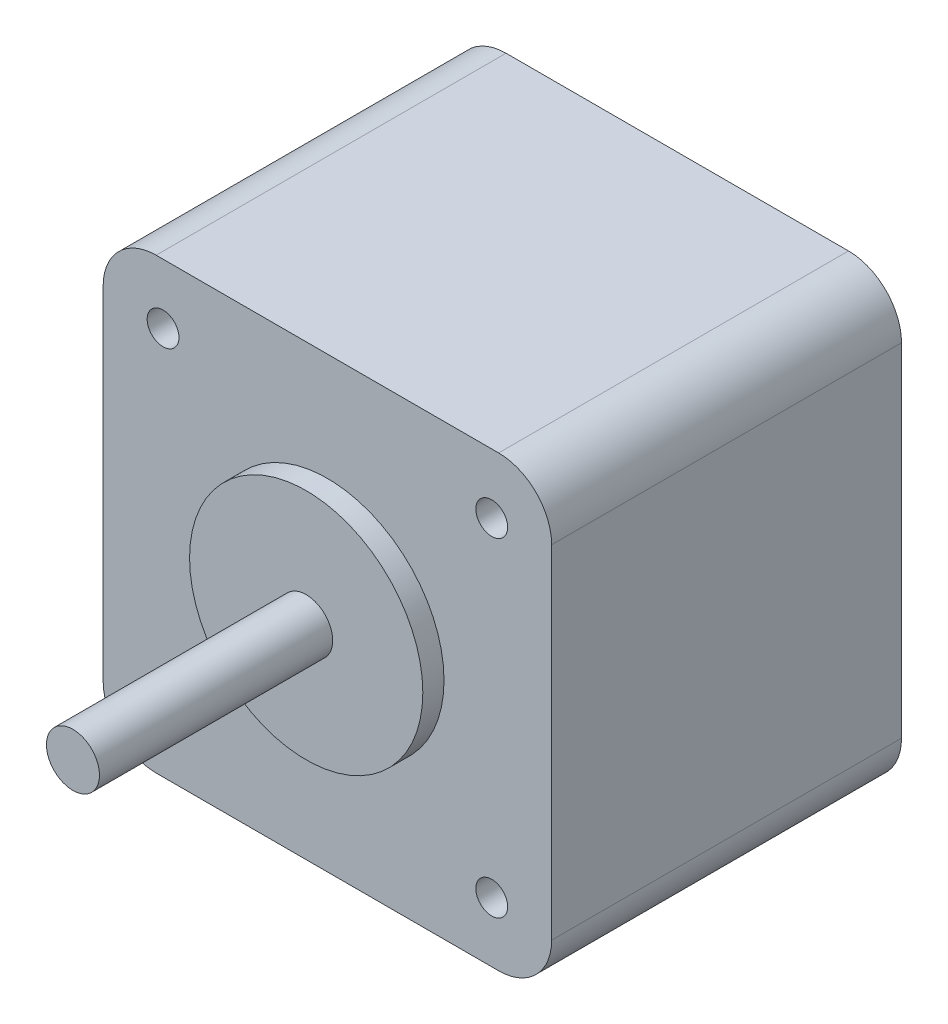
ISO-10303-21;
HEADER;
FILE_DESCRIPTION(('STEP AP214'),'2;1');
FILE_NAME('part.step','',(''),(''),'','','');
FILE_SCHEMA(('AUTOMOTIVE_DESIGN { 1 0 10303 214 1 1 1 1 }'));
ENDSEC;
DATA;
#1=APPLICATION_CONTEXT('core data for automotive mechanical design processes');
#2=APPLICATION_PROTOCOL_DEFINITION('international standard','automotive_design',2000,#1);
#3=PRODUCT_CONTEXT('',#1,'mechanical');
#4=PRODUCT('Part','Part','',(#3));
#5=PRODUCT_RELATED_PRODUCT_CATEGORY('part','',(#4));
#6=PRODUCT_DEFINITION_FORMATION('','',#4);
#7=PRODUCT_DEFINITION_CONTEXT('part definition',#1,'design');
#8=PRODUCT_DEFINITION('design','',#6,#7);
#9=PRODUCT_DEFINITION_SHAPE('','',#8);
#10=(LENGTH_UNIT() NAMED_UNIT(*) SI_UNIT(.MILLI.,.METRE.));
#11=(NAMED_UNIT(*) PLANE_ANGLE_UNIT() SI_UNIT($,.RADIAN.));
#12=(NAMED_UNIT(*) SI_UNIT($,.STERADIAN.) SOLID_ANGLE_UNIT());
#13=UNCERTAINTY_MEASURE_WITH_UNIT(LENGTH_MEASURE(1.E-05),#10,'distance_accuracy_value','');
#14=(GEOMETRIC_REPRESENTATION_CONTEXT(3) GLOBAL_UNCERTAINTY_ASSIGNED_CONTEXT((#13)) GLOBAL_UNIT_ASSIGNED_CONTEXT((#10,
#11,#12)) REPRESENTATION_CONTEXT('',''));
#15=CARTESIAN_POINT('',(0.,0.,0.));
#16=DIRECTION('',(0.,0.,1.));
#17=DIRECTION('',(1.,0.,0.));
#18=AXIS2_PLACEMENT_3D('',#15,#16,#17);
#19=CARTESIAN_POINT('',(-16.15,-16.15,16.5));
#20=DIRECTION('',(0.,0.,-1.));
#21=DIRECTION('',(-1.,0.,0.));
#22=AXIS2_PLACEMENT_3D('',#19,#20,#21);
#23=PLANE('',#22);
#24=CARTESIAN_POINT('',(-15.5,-15.5,16.5));
#25=DIRECTION('',(0.,0.,1.));
#26=DIRECTION('',(1.,0.,0.));
#27=AXIS2_PLACEMENT_3D('',#24,#25,#26);
#28=CIRCLE('',#27,1.5);
#29=CARTESIAN_POINT('',(-14.,-15.5,16.5));
#30=VERTEX_POINT('',#29);
#31=EDGE_CURVE('E166',#30,#30,#28,.T.);
#32=ORIENTED_EDGE('',*,*,#31,.F.);
#33=EDGE_LOOP('',(#32));
#34=FACE_BOUND('',#33,.T.);
#35=CARTESIAN_POINT('',(15.5,-15.5,16.5));
#36=DIRECTION('',(0.,0.,1.));
#37=DIRECTION('',(1.,0.,0.));
#38=AXIS2_PLACEMENT_3D('',#35,#36,#37);
#39=CIRCLE('',#38,1.5);
#40=CARTESIAN_POINT('',(17.,-15.5,16.5));
#41=VERTEX_POINT('',#40);
#42=EDGE_CURVE('E176',#41,#41,#39,.T.);
#43=ORIENTED_EDGE('',*,*,#42,.F.);
#44=EDGE_LOOP('',(#43));
#45=FACE_BOUND('',#44,.T.);
#46=CARTESIAN_POINT('',(15.5,15.5,16.5));
#47=DIRECTION('',(0.,0.,1.));
#48=DIRECTION('',(1.,0.,0.));
#49=AXIS2_PLACEMENT_3D('',#46,#47,#48);
#50=CIRCLE('',#49,1.5);
#51=CARTESIAN_POINT('',(17.,15.5,16.5));
#52=VERTEX_POINT('',#51);
#53=EDGE_CURVE('E182',#52,#52,#50,.T.);
#54=ORIENTED_EDGE('',*,*,#53,.F.);
#55=EDGE_LOOP('',(#54));
#56=FACE_BOUND('',#55,.T.);
#57=CARTESIAN_POINT('',(-15.5,15.5,16.5));
#58=DIRECTION('',(0.,0.,1.));
#59=DIRECTION('',(1.,0.,0.));
#60=AXIS2_PLACEMENT_3D('',#57,#58,#59);
#61=CIRCLE('',#60,1.5);
#62=CARTESIAN_POINT('',(-14.,15.5,16.5));
#63=VERTEX_POINT('',#62);
#64=EDGE_CURVE('E188',#63,#63,#61,.T.);
#65=ORIENTED_EDGE('',*,*,#64,.F.);
#66=EDGE_LOOP('',(#65));
#67=FACE_BOUND('',#66,.T.);
#68=CARTESIAN_POINT('',(-16.15,-16.15,16.5));
#69=DIRECTION('',(0.,0.,1.));
#70=DIRECTION('',(-1.,0.,0.));
#71=AXIS2_PLACEMENT_3D('',#68,#69,#70);
#72=CIRCLE('',#71,5.);
#73=CARTESIAN_POINT('',(-21.15,-16.15,16.5));
#74=VERTEX_POINT('',#73);
#75=CARTESIAN_POINT('',(-16.15,-21.15,16.5));
#76=VERTEX_POINT('',#75);
#77=EDGE_CURVE('E146',#74,#76,#72,.T.);
#78=ORIENTED_EDGE('',*,*,#77,.T.);
#79=DIRECTION('',(1.,0.,0.));
#80=VECTOR('',#79,1.);
#81=CARTESIAN_POINT('',(-16.15,-21.15,16.5));
#82=LINE('',#81,#80);
#83=CARTESIAN_POINT('',(16.15,-21.15,16.5));
#84=VERTEX_POINT('',#83);
#85=EDGE_CURVE('E94',#76,#84,#82,.T.);
#86=ORIENTED_EDGE('',*,*,#85,.T.);
#87=CARTESIAN_POINT('',(16.15,-16.15,16.5));
#88=DIRECTION('',(0.,0.,1.));
#89=DIRECTION('',(1.,0.,0.));
#90=AXIS2_PLACEMENT_3D('',#87,#88,#89);
#91=CIRCLE('',#90,5.);
#92=CARTESIAN_POINT('',(21.15,-16.15,16.5));
#93=VERTEX_POINT('',#92);
#94=EDGE_CURVE('E197',#84,#93,#91,.T.);
#95=ORIENTED_EDGE('',*,*,#94,.T.);
#96=DIRECTION('',(0.,1.,0.));
#97=VECTOR('',#96,1.);
#98=CARTESIAN_POINT('',(21.15,-16.15,16.5));
#99=LINE('',#98,#97);
#100=CARTESIAN_POINT('',(21.15,16.15,16.5));
#101=VERTEX_POINT('',#100);
#102=EDGE_CURVE('E199',#93,#101,#99,.T.);
#103=ORIENTED_EDGE('',*,*,#102,.T.);
#104=CARTESIAN_POINT('',(16.15,16.15,16.5));
#105=DIRECTION('',(0.,0.,1.));
#106=DIRECTION('',(-1.,0.,0.));
#107=AXIS2_PLACEMENT_3D('',#104,#105,#106);
#108=CIRCLE('',#107,5.);
#109=CARTESIAN_POINT('',(16.15,21.15,16.5));
#110=VERTEX_POINT('',#109);
#111=EDGE_CURVE('E113',#101,#110,#108,.T.);
#112=ORIENTED_EDGE('',*,*,#111,.T.);
#113=DIRECTION('',(-1.,0.,0.));
#114=VECTOR('',#113,1.);
#115=CARTESIAN_POINT('',(-16.15,21.15,16.5));
#116=LINE('',#115,#114);
#117=CARTESIAN_POINT('',(-16.15,21.15,16.5));
#118=VERTEX_POINT('',#117);
#119=EDGE_CURVE('E107',#110,#118,#116,.T.);
#120=ORIENTED_EDGE('',*,*,#119,.T.);
#121=CARTESIAN_POINT('',(-16.15,16.15,16.5));
#122=DIRECTION('',(0.,0.,1.));
#123=DIRECTION('',(1.,0.,0.));
#124=AXIS2_PLACEMENT_3D('',#121,#122,#123);
#125=CIRCLE('',#124,5.);
#126=CARTESIAN_POINT('',(-21.15,16.15,16.5));
#127=VERTEX_POINT('',#126);
#128=EDGE_CURVE('E111',#118,#127,#125,.T.);
#129=ORIENTED_EDGE('',*,*,#128,.T.);
#130=DIRECTION('',(0.,-1.,0.));
#131=VECTOR('',#130,1.);
#132=CARTESIAN_POINT('',(-21.15,-16.15,16.5));
#133=LINE('',#132,#131);
#134=EDGE_CURVE('E50',#127,#74,#133,.T.);
#135=ORIENTED_EDGE('',*,*,#134,.T.);
#136=EDGE_LOOP('',(#78,#86,#95,#103,#112,#120,#129,#135));
#137=FACE_BOUND('',#136,.T.);
#138=CARTESIAN_POINT('',(0.,0.,16.5));
#139=DIRECTION('',(0.,0.,-1.));
#140=DIRECTION('',(-1.,0.,0.));
#141=AXIS2_PLACEMENT_3D('',#138,#139,#140);
#142=CIRCLE('',#141,11.);
#143=CARTESIAN_POINT('',(-11.,0.,16.5));
#144=VERTEX_POINT('',#143);
#145=EDGE_CURVE('E11',#144,#144,#142,.F.);
#146=ORIENTED_EDGE('',*,*,#145,.F.);
#147=EDGE_LOOP('',(#146));
#148=FACE_BOUND('',#147,.T.);
#149=ADVANCED_FACE('F33',(#34,#45,#56,#67,#137,#148),#23,.F.);
#150=CARTESIAN_POINT('',(-16.15,-16.15,16.5));
#151=DIRECTION('',(0.,0.,-1.));
#152=DIRECTION('',(-1.,0.,0.));
#153=AXIS2_PLACEMENT_3D('',#150,#151,#152);
#154=CYLINDRICAL_SURFACE('',#153,5.);
#155=CARTESIAN_POINT('',(-16.15,-16.15,-16.5));
#156=DIRECTION('',(0.,0.,1.));
#157=DIRECTION('',(-1.,0.,0.));
#158=AXIS2_PLACEMENT_3D('',#155,#156,#157);
#159=CIRCLE('',#158,5.);
#160=CARTESIAN_POINT('',(-21.15,-16.15,-16.5));
#161=VERTEX_POINT('',#160);
#162=CARTESIAN_POINT('',(-16.15,-21.15,-16.5));
#163=VERTEX_POINT('',#162);
#164=EDGE_CURVE('E131',#161,#163,#159,.T.);
#165=ORIENTED_EDGE('',*,*,#164,.T.);
#166=DIRECTION('',(0.,0.,-1.));
#167=VECTOR('',#166,1.);
#168=CARTESIAN_POINT('',(-16.15,-21.15,16.5));
#169=LINE('',#168,#167);
#170=EDGE_CURVE('E42',#76,#163,#169,.T.);
#171=ORIENTED_EDGE('',*,*,#170,.F.);
#172=ORIENTED_EDGE('',*,*,#77,.F.);
#173=DIRECTION('',(0.,0.,-1.));
#174=VECTOR('',#173,1.);
#175=CARTESIAN_POINT('',(-21.15,-16.15,16.5));
#176=LINE('',#175,#174);
#177=EDGE_CURVE('E127',#74,#161,#176,.T.);
#178=ORIENTED_EDGE('',*,*,#177,.T.);
#179=EDGE_LOOP('',(#165,#171,#172,#178));
#180=FACE_BOUND('',#179,.T.);
#181=ADVANCED_FACE('F35',(#180),#154,.T.);
#182=CARTESIAN_POINT('',(-16.15,-21.15,16.5));
#183=DIRECTION('',(0.,1.,0.));
#184=DIRECTION('',(0.,0.,1.));
#185=AXIS2_PLACEMENT_3D('',#182,#183,#184);
#186=PLANE('',#185);
#187=DIRECTION('',(1.,0.,0.));
#188=VECTOR('',#187,1.);
#189=CARTESIAN_POINT('',(-16.15,-21.15,-16.5));
#190=LINE('',#189,#188);
#191=CARTESIAN_POINT('',(16.15,-21.15,-16.5));
#192=VERTEX_POINT('',#191);
#193=EDGE_CURVE('E134',#163,#192,#190,.T.);
#194=ORIENTED_EDGE('',*,*,#193,.T.);
#195=DIRECTION('',(0.,0.,-1.));
#196=VECTOR('',#195,1.);
#197=CARTESIAN_POINT('',(16.15,-21.15,16.5));
#198=LINE('',#197,#196);
#199=EDGE_CURVE('E156',#84,#192,#198,.T.);
#200=ORIENTED_EDGE('',*,*,#199,.F.);
#201=ORIENTED_EDGE('',*,*,#85,.F.);
#202=ORIENTED_EDGE('',*,*,#170,.T.);
#203=EDGE_LOOP('',(#194,#200,#201,#202));
#204=FACE_BOUND('',#203,.T.);
#205=ADVANCED_FACE('F234',(#204),#186,.F.);
#206=CARTESIAN_POINT('',(16.15,-16.15,16.5));
#207=DIRECTION('',(0.,0.,-1.));
#208=DIRECTION('',(-1.,0.,0.));
#209=AXIS2_PLACEMENT_3D('',#206,#207,#208);
#210=CYLINDRICAL_SURFACE('',#209,5.);
#211=CARTESIAN_POINT('',(16.15,-16.15,-16.5));
#212=DIRECTION('',(0.,0.,1.));
#213=DIRECTION('',(1.,0.,0.));
#214=AXIS2_PLACEMENT_3D('',#211,#212,#213);
#215=CIRCLE('',#214,5.);
#216=CARTESIAN_POINT('',(21.15,-16.15,-16.5));
#217=VERTEX_POINT('',#216);
#218=EDGE_CURVE('E137',#192,#217,#215,.T.);
#219=ORIENTED_EDGE('',*,*,#218,.T.);
#220=DIRECTION('',(0.,0.,-1.));
#221=VECTOR('',#220,1.);
#222=CARTESIAN_POINT('',(21.15,-16.15,16.5));
#223=LINE('',#222,#221);
#224=EDGE_CURVE('E153',#93,#217,#223,.T.);
#225=ORIENTED_EDGE('',*,*,#224,.F.);
#226=ORIENTED_EDGE('',*,*,#94,.F.);
#227=ORIENTED_EDGE('',*,*,#199,.T.);
#228=EDGE_LOOP('',(#219,#225,#226,#227));
#229=FACE_BOUND('',#228,.T.);
#230=ADVANCED_FACE('F350',(#229),#210,.T.);
#231=CARTESIAN_POINT('',(21.15,-16.15,16.5));
#232=DIRECTION('',(-1.,0.,0.));
#233=DIRECTION('',(0.,0.,1.));
#234=AXIS2_PLACEMENT_3D('',#231,#232,#233);
#235=PLANE('',#234);
#236=DIRECTION('',(0.,1.,0.));
#237=VECTOR('',#236,1.);
#238=CARTESIAN_POINT('',(21.15,-16.15,-16.5));
#239=LINE('',#238,#237);
#240=CARTESIAN_POINT('',(21.15,16.15,-16.5));
#241=VERTEX_POINT('',#240);
#242=EDGE_CURVE('E139',#217,#241,#239,.T.);
#243=ORIENTED_EDGE('',*,*,#242,.T.);
#244=DIRECTION('',(0.,0.,-1.));
#245=VECTOR('',#244,1.);
#246=CARTESIAN_POINT('',(21.15,16.15,16.5));
#247=LINE('',#246,#245);
#248=EDGE_CURVE('E150',#101,#241,#247,.T.);
#249=ORIENTED_EDGE('',*,*,#248,.F.);
#250=ORIENTED_EDGE('',*,*,#102,.F.);
#251=ORIENTED_EDGE('',*,*,#224,.T.);
#252=EDGE_LOOP('',(#243,#249,#250,#251));
#253=FACE_BOUND('',#252,.T.);
#254=ADVANCED_FACE('F205',(#253),#235,.F.);
#255=CARTESIAN_POINT('',(16.15,16.15,16.5));
#256=DIRECTION('',(0.,0.,-1.));
#257=DIRECTION('',(-1.,0.,0.));
#258=AXIS2_PLACEMENT_3D('',#255,#256,#257);
#259=CYLINDRICAL_SURFACE('',#258,5.);
#260=CARTESIAN_POINT('',(16.15,16.15,-16.5));
#261=DIRECTION('',(0.,0.,1.));
#262=DIRECTION('',(-1.,0.,0.));
#263=AXIS2_PLACEMENT_3D('',#260,#261,#262);
#264=CIRCLE('',#263,5.);
#265=CARTESIAN_POINT('',(16.15,21.15,-16.5));
#266=VERTEX_POINT('',#265);
#267=EDGE_CURVE('E141',#241,#266,#264,.T.);
#268=ORIENTED_EDGE('',*,*,#267,.T.);
#269=DIRECTION('',(0.,0.,-1.));
#270=VECTOR('',#269,1.);
#271=CARTESIAN_POINT('',(16.15,21.15,16.5));
#272=LINE('',#271,#270);
#273=EDGE_CURVE('E122',#110,#266,#272,.T.);
#274=ORIENTED_EDGE('',*,*,#273,.F.);
#275=ORIENTED_EDGE('',*,*,#111,.F.);
#276=ORIENTED_EDGE('',*,*,#248,.T.);
#277=EDGE_LOOP('',(#268,#274,#275,#276));
#278=FACE_BOUND('',#277,.T.);
#279=ADVANCED_FACE('F209',(#278),#259,.T.);
#280=CARTESIAN_POINT('',(-16.15,21.15,16.5));
#281=DIRECTION('',(0.,-1.,0.));
#282=DIRECTION('',(0.,0.,-1.));
#283=AXIS2_PLACEMENT_3D('',#280,#281,#282);
#284=PLANE('',#283);
#285=DIRECTION('',(-1.,0.,0.));
#286=VECTOR('',#285,1.);
#287=CARTESIAN_POINT('',(-16.15,21.15,-16.5));
#288=LINE('',#287,#286);
#289=CARTESIAN_POINT('',(-16.15,21.15,-16.5));
#290=VERTEX_POINT('',#289);
#291=EDGE_CURVE('E121',#266,#290,#288,.T.);
#292=ORIENTED_EDGE('',*,*,#291,.T.);
#293=DIRECTION('',(0.,0.,-1.));
#294=VECTOR('',#293,1.);
#295=CARTESIAN_POINT('',(-16.15,21.15,16.5));
#296=LINE('',#295,#294);
#297=EDGE_CURVE('E118',#118,#290,#296,.T.);
#298=ORIENTED_EDGE('',*,*,#297,.F.);
#299=ORIENTED_EDGE('',*,*,#119,.F.);
#300=ORIENTED_EDGE('',*,*,#273,.T.);
#301=EDGE_LOOP('',(#292,#298,#299,#300));
#302=FACE_BOUND('',#301,.T.);
#303=ADVANCED_FACE('F119',(#302),#284,.F.);
#304=CARTESIAN_POINT('',(-16.15,16.15,16.5));
#305=DIRECTION('',(0.,0.,-1.));
#306=DIRECTION('',(-1.,0.,0.));
#307=AXIS2_PLACEMENT_3D('',#304,#305,#306);
#308=CYLINDRICAL_SURFACE('',#307,5.);
#309=CARTESIAN_POINT('',(-16.15,16.15,-16.5));
#310=DIRECTION('',(0.,0.,1.));
#311=DIRECTION('',(1.,0.,0.));
#312=AXIS2_PLACEMENT_3D('',#309,#310,#311);
#313=CIRCLE('',#312,5.);
#314=CARTESIAN_POINT('',(-21.15,16.15,-16.5));
#315=VERTEX_POINT('',#314);
#316=EDGE_CURVE('E79',#290,#315,#313,.T.);
#317=ORIENTED_EDGE('',*,*,#316,.T.);
#318=DIRECTION('',(0.,0.,-1.));
#319=VECTOR('',#318,1.);
#320=CARTESIAN_POINT('',(-21.15,16.15,16.5));
#321=LINE('',#320,#319);
#322=EDGE_CURVE('E123',#127,#315,#321,.T.);
#323=ORIENTED_EDGE('',*,*,#322,.F.);
#324=ORIENTED_EDGE('',*,*,#128,.F.);
#325=ORIENTED_EDGE('',*,*,#297,.T.);
#326=EDGE_LOOP('',(#317,#323,#324,#325));
#327=FACE_BOUND('',#326,.T.);
#328=ADVANCED_FACE('F125',(#327),#308,.T.);
#329=CARTESIAN_POINT('',(-21.15,-16.15,16.5));
#330=DIRECTION('',(1.,0.,0.));
#331=DIRECTION('',(0.,0.,-1.));
#332=AXIS2_PLACEMENT_3D('',#329,#330,#331);
#333=PLANE('',#332);
#334=DIRECTION('',(0.,-1.,0.));
#335=VECTOR('',#334,1.);
#336=CARTESIAN_POINT('',(-21.15,-16.15,-16.5));
#337=LINE('',#336,#335);
#338=EDGE_CURVE('E85',#315,#161,#337,.T.);
#339=ORIENTED_EDGE('',*,*,#338,.T.);
#340=ORIENTED_EDGE('',*,*,#177,.F.);
#341=ORIENTED_EDGE('',*,*,#134,.F.);
#342=ORIENTED_EDGE('',*,*,#322,.T.);
#343=EDGE_LOOP('',(#339,#340,#341,#342));
#344=FACE_BOUND('',#343,.T.);
#345=ADVANCED_FACE('F217',(#344),#333,.F.);
#346=CARTESIAN_POINT('',(-16.15,-16.15,-16.5));
#347=DIRECTION('',(0.,0.,-1.));
#348=DIRECTION('',(-1.,0.,0.));
#349=AXIS2_PLACEMENT_3D('',#346,#347,#348);
#350=PLANE('',#349);
#351=CARTESIAN_POINT('',(-15.5,-15.5,-16.5));
#352=DIRECTION('',(0.,0.,1.));
#353=DIRECTION('',(1.,0.,0.));
#354=AXIS2_PLACEMENT_3D('',#351,#352,#353);
#355=CIRCLE('',#354,1.5);
#356=CARTESIAN_POINT('',(-14.,-15.5,-16.5));
#357=VERTEX_POINT('',#356);
#358=EDGE_CURVE('E173',#357,#357,#355,.T.);
#359=ORIENTED_EDGE('',*,*,#358,.T.);
#360=EDGE_LOOP('',(#359));
#361=FACE_BOUND('',#360,.T.);
#362=CARTESIAN_POINT('',(15.5,-15.5,-16.5));
#363=DIRECTION('',(0.,0.,1.));
#364=DIRECTION('',(1.,0.,0.));
#365=AXIS2_PLACEMENT_3D('',#362,#363,#364);
#366=CIRCLE('',#365,1.5);
#367=CARTESIAN_POINT('',(17.,-15.5,-16.5));
#368=VERTEX_POINT('',#367);
#369=EDGE_CURVE('E179',#368,#368,#366,.T.);
#370=ORIENTED_EDGE('',*,*,#369,.T.);
#371=EDGE_LOOP('',(#370));
#372=FACE_BOUND('',#371,.T.);
#373=CARTESIAN_POINT('',(15.5,15.5,-16.5));
#374=DIRECTION('',(0.,0.,1.));
#375=DIRECTION('',(1.,0.,0.));
#376=AXIS2_PLACEMENT_3D('',#373,#374,#375);
#377=CIRCLE('',#376,1.5);
#378=CARTESIAN_POINT('',(17.,15.5,-16.5));
#379=VERTEX_POINT('',#378);
#380=EDGE_CURVE('E185',#379,#379,#377,.T.);
#381=ORIENTED_EDGE('',*,*,#380,.T.);
#382=EDGE_LOOP('',(#381));
#383=FACE_BOUND('',#382,.T.);
#384=CARTESIAN_POINT('',(-15.5,15.5,-16.5));
#385=DIRECTION('',(0.,0.,1.));
#386=DIRECTION('',(1.,0.,0.));
#387=AXIS2_PLACEMENT_3D('',#384,#385,#386);
#388=CIRCLE('',#387,1.5);
#389=CARTESIAN_POINT('',(-14.,15.5,-16.5));
#390=VERTEX_POINT('',#389);
#391=EDGE_CURVE('E135',#390,#390,#388,.T.);
#392=ORIENTED_EDGE('',*,*,#391,.T.);
#393=EDGE_LOOP('',(#392));
#394=FACE_BOUND('',#393,.T.);
#395=ORIENTED_EDGE('',*,*,#164,.F.);
#396=ORIENTED_EDGE('',*,*,#338,.F.);
#397=ORIENTED_EDGE('',*,*,#316,.F.);
#398=ORIENTED_EDGE('',*,*,#291,.F.);
#399=ORIENTED_EDGE('',*,*,#267,.F.);
#400=ORIENTED_EDGE('',*,*,#242,.F.);
#401=ORIENTED_EDGE('',*,*,#218,.F.);
#402=ORIENTED_EDGE('',*,*,#193,.F.);
#403=EDGE_LOOP('',(#395,#396,#397,#398,#399,#400,#401,#402));
#404=FACE_BOUND('',#403,.T.);
#405=ADVANCED_FACE('F212',(#361,#372,#383,#394,#404),#350,.T.);
#406=CARTESIAN_POINT('',(-15.5,15.5,-16.5));
#407=DIRECTION('',(0.,0.,1.));
#408=DIRECTION('',(1.,0.,0.));
#409=AXIS2_PLACEMENT_3D('',#406,#407,#408);
#410=CYLINDRICAL_SURFACE('',#409,1.5);
#411=ORIENTED_EDGE('',*,*,#391,.F.);
#412=EDGE_LOOP('',(#411));
#413=FACE_BOUND('',#412,.T.);
#414=ORIENTED_EDGE('',*,*,#64,.T.);
#415=EDGE_LOOP('',(#414));
#416=FACE_BOUND('',#415,.T.);
#417=ADVANCED_FACE('F224',(#413,#416),#410,.F.);
#418=CARTESIAN_POINT('',(15.5,15.5,-16.5));
#419=DIRECTION('',(0.,0.,1.));
#420=DIRECTION('',(1.,0.,0.));
#421=AXIS2_PLACEMENT_3D('',#418,#419,#420);
#422=CYLINDRICAL_SURFACE('',#421,1.5);
#423=ORIENTED_EDGE('',*,*,#380,.F.);
#424=EDGE_LOOP('',(#423));
#425=FACE_BOUND('',#424,.T.);
#426=ORIENTED_EDGE('',*,*,#53,.T.);
#427=EDGE_LOOP('',(#426));
#428=FACE_BOUND('',#427,.T.);
#429=ADVANCED_FACE('F240',(#425,#428),#422,.F.);
#430=CARTESIAN_POINT('',(15.5,-15.5,-16.5));
#431=DIRECTION('',(0.,0.,1.));
#432=DIRECTION('',(1.,0.,0.));
#433=AXIS2_PLACEMENT_3D('',#430,#431,#432);
#434=CYLINDRICAL_SURFACE('',#433,1.5);
#435=ORIENTED_EDGE('',*,*,#369,.F.);
#436=EDGE_LOOP('',(#435));
#437=FACE_BOUND('',#436,.T.);
#438=ORIENTED_EDGE('',*,*,#42,.T.);
#439=EDGE_LOOP('',(#438));
#440=FACE_BOUND('',#439,.T.);
#441=ADVANCED_FACE('F244',(#437,#440),#434,.F.);
#442=CARTESIAN_POINT('',(-15.5,-15.5,-16.5));
#443=DIRECTION('',(0.,0.,1.));
#444=DIRECTION('',(1.,0.,0.));
#445=AXIS2_PLACEMENT_3D('',#442,#443,#444);
#446=CYLINDRICAL_SURFACE('',#445,1.5);
#447=ORIENTED_EDGE('',*,*,#358,.F.);
#448=EDGE_LOOP('',(#447));
#449=FACE_BOUND('',#448,.T.);
#450=ORIENTED_EDGE('',*,*,#31,.T.);
#451=EDGE_LOOP('',(#450));
#452=FACE_BOUND('',#451,.T.);
#453=ADVANCED_FACE('F248',(#449,#452),#446,.F.);
#454=CARTESIAN_POINT('',(0.,0.,18.5));
#455=DIRECTION('',(0.,0.,1.));
#456=DIRECTION('',(1.,0.,0.));
#457=AXIS2_PLACEMENT_3D('',#454,#455,#456);
#458=PLANE('',#457);
#459=CARTESIAN_POINT('',(0.,0.,18.5));
#460=DIRECTION('',(0.,0.,1.));
#461=DIRECTION('',(1.,0.,0.));
#462=AXIS2_PLACEMENT_3D('',#459,#460,#461);
#463=CIRCLE('',#462,11.);
#464=CARTESIAN_POINT('',(11.,0.,18.5));
#465=VERTEX_POINT('',#464);
#466=EDGE_CURVE('E162',#465,#465,#463,.T.);
#467=ORIENTED_EDGE('',*,*,#466,.T.);
#468=EDGE_LOOP('',(#467));
#469=FACE_BOUND('',#468,.T.);
#470=CARTESIAN_POINT('',(0.,0.,18.5));
#471=DIRECTION('',(0.,0.,1.));
#472=DIRECTION('',(1.,0.,0.));
#473=AXIS2_PLACEMENT_3D('',#470,#471,#472);
#474=CIRCLE('',#473,2.5);
#475=CARTESIAN_POINT('',(2.5,0.,18.5));
#476=VERTEX_POINT('',#475);
#477=EDGE_CURVE('E159',#476,#476,#474,.T.);
#478=ORIENTED_EDGE('',*,*,#477,.F.);
#479=EDGE_LOOP('',(#478));
#480=FACE_BOUND('',#479,.T.);
#481=ADVANCED_FACE('F252',(#469,#480),#458,.T.);
#482=CARTESIAN_POINT('',(0.,0.,18.5));
#483=DIRECTION('',(0.,0.,-1.));
#484=DIRECTION('',(-1.,0.,0.));
#485=AXIS2_PLACEMENT_3D('',#482,#483,#484);
#486=CYLINDRICAL_SURFACE('',#485,11.);
#487=ORIENTED_EDGE('',*,*,#466,.F.);
#488=EDGE_LOOP('',(#487));
#489=FACE_BOUND('',#488,.T.);
#490=ORIENTED_EDGE('',*,*,#145,.T.);
#491=EDGE_LOOP('',(#490));
#492=FACE_BOUND('',#491,.T.);
#493=ADVANCED_FACE('F260',(#489,#492),#486,.T.);
#494=CARTESIAN_POINT('',(0.,0.,40.5));
#495=DIRECTION('',(0.,0.,1.));
#496=DIRECTION('',(1.,0.,0.));
#497=AXIS2_PLACEMENT_3D('',#494,#495,#496);
#498=PLANE('',#497);
#499=CARTESIAN_POINT('',(0.,0.,40.5));
#500=DIRECTION('',(0.,0.,1.));
#501=DIRECTION('',(1.,0.,0.));
#502=AXIS2_PLACEMENT_3D('',#499,#500,#501);
#503=CIRCLE('',#502,2.5);
#504=CARTESIAN_POINT('',(2.5,0.,40.5));
#505=VERTEX_POINT('',#504);
#506=EDGE_CURVE('E161',#505,#505,#503,.T.);
#507=ORIENTED_EDGE('',*,*,#506,.T.);
#508=EDGE_LOOP('',(#507));
#509=FACE_BOUND('',#508,.T.);
#510=ADVANCED_FACE('F257',(#509),#498,.T.);
#511=CARTESIAN_POINT('',(0.,0.,40.5));
#512=DIRECTION('',(0.,0.,-1.));
#513=DIRECTION('',(-1.,0.,0.));
#514=AXIS2_PLACEMENT_3D('',#511,#512,#513);
#515=CYLINDRICAL_SURFACE('',#514,2.5);
#516=ORIENTED_EDGE('',*,*,#477,.T.);
#517=EDGE_LOOP('',(#516));
#518=FACE_BOUND('',#517,.T.);
#519=ORIENTED_EDGE('',*,*,#506,.F.);
#520=EDGE_LOOP('',(#519));
#521=FACE_BOUND('',#520,.T.);
#522=ADVANCED_FACE('F254',(#518,#521),#515,.T.);
#523=CLOSED_SHELL('',(#149,#181,#205,#230,#254,#279,#303,#328,#345,#405,#417,#429,#441,#453,
#481,#493,#510,#522));
#524=MANIFOLD_SOLID_BREP('B2',#523);
#525=ADVANCED_BREP_SHAPE_REPRESENTATION('',(#18,#524),#14);
#526=SHAPE_DEFINITION_REPRESENTATION(#9,#525);
ENDSEC;
END-ISO-10303-21;
